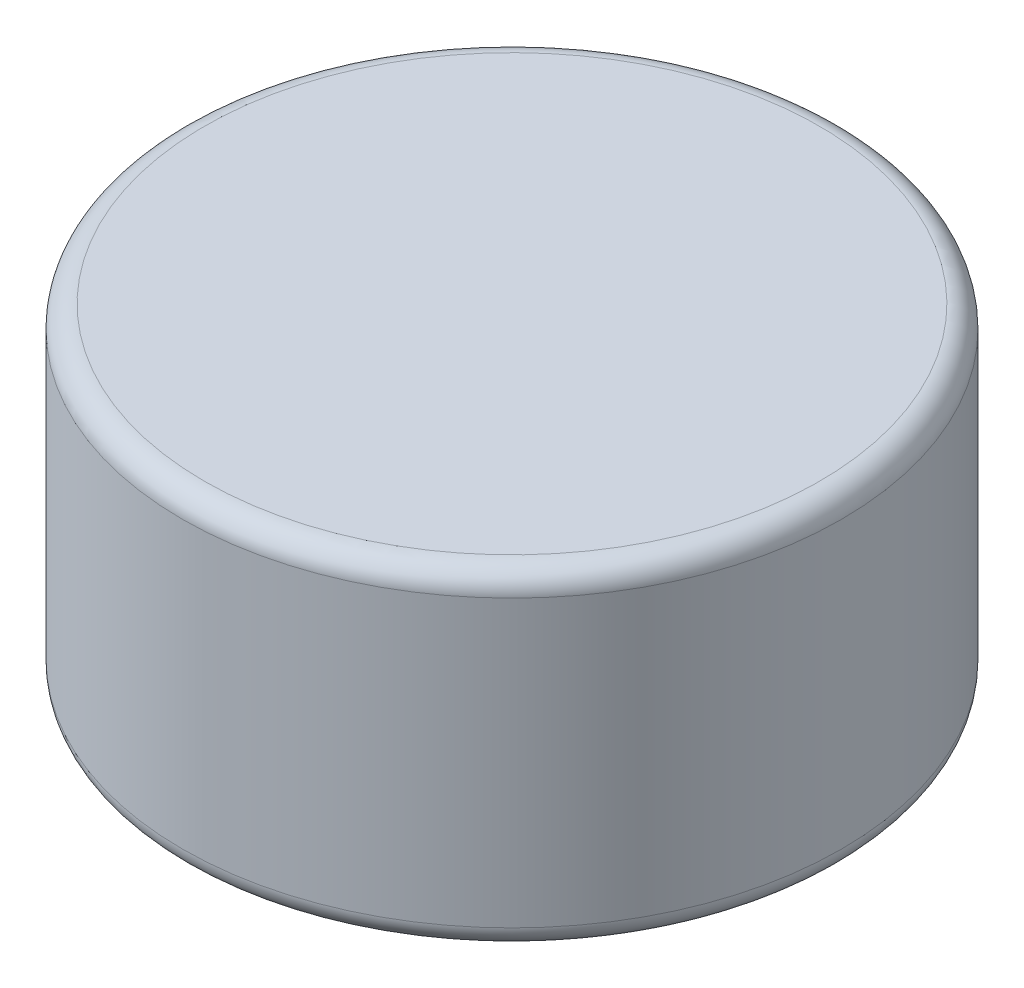
ISO-10303-21;
HEADER;
FILE_DESCRIPTION(('STEP AP214'),'2;1');
FILE_NAME('part.step','',(''),(''),'','','');
FILE_SCHEMA(('AUTOMOTIVE_DESIGN { 1 0 10303 214 1 1 1 1 }'));
ENDSEC;
DATA;
#1=APPLICATION_CONTEXT('core data for automotive mechanical design processes');
#2=APPLICATION_PROTOCOL_DEFINITION('international standard','automotive_design',2000,#1);
#3=PRODUCT_CONTEXT('',#1,'mechanical');
#4=PRODUCT('Part','Part','',(#3));
#5=PRODUCT_RELATED_PRODUCT_CATEGORY('part','',(#4));
#6=PRODUCT_DEFINITION_FORMATION('','',#4);
#7=PRODUCT_DEFINITION_CONTEXT('part definition',#1,'design');
#8=PRODUCT_DEFINITION('design','',#6,#7);
#9=PRODUCT_DEFINITION_SHAPE('','',#8);
#10=(LENGTH_UNIT() NAMED_UNIT(*) SI_UNIT(.MILLI.,.METRE.));
#11=(NAMED_UNIT(*) PLANE_ANGLE_UNIT() SI_UNIT($,.RADIAN.));
#12=(NAMED_UNIT(*) SI_UNIT($,.STERADIAN.) SOLID_ANGLE_UNIT());
#13=UNCERTAINTY_MEASURE_WITH_UNIT(LENGTH_MEASURE(1.E-05),#10,'distance_accuracy_value','');
#14=(GEOMETRIC_REPRESENTATION_CONTEXT(3) GLOBAL_UNCERTAINTY_ASSIGNED_CONTEXT((#13)) GLOBAL_UNIT_ASSIGNED_CONTEXT((#10,
#11,#12)) REPRESENTATION_CONTEXT('',''));
#15=CARTESIAN_POINT('',(0.,0.,0.));
#16=DIRECTION('',(0.,0.,1.));
#17=DIRECTION('',(1.,0.,0.));
#18=AXIS2_PLACEMENT_3D('',#15,#16,#17);
#19=CARTESIAN_POINT('',(0.,3.,0.));
#20=DIRECTION('',(0.,-1.,0.));
#21=DIRECTION('',(0.,0.,-1.));
#22=AXIS2_PLACEMENT_3D('',#19,#20,#21);
#23=CYLINDRICAL_SURFACE('',#22,3.);
#24=CARTESIAN_POINT('',(0.,0.2,0.));
#25=DIRECTION('',(0.,1.,0.));
#26=DIRECTION('',(0.,0.,1.));
#27=AXIS2_PLACEMENT_3D('',#24,#25,#26);
#28=CIRCLE('',#27,3.);
#29=CARTESIAN_POINT('',(0.,0.2,3.));
#30=VERTEX_POINT('',#29);
#31=EDGE_CURVE('E53',#30,#30,#28,.T.);
#32=ORIENTED_EDGE('',*,*,#31,.T.);
#33=EDGE_LOOP('',(#32));
#34=FACE_BOUND('',#33,.T.);
#35=CARTESIAN_POINT('',(0.,2.8,0.));
#36=DIRECTION('',(0.,1.,0.));
#37=DIRECTION('',(0.,0.,1.));
#38=AXIS2_PLACEMENT_3D('',#35,#36,#37);
#39=CIRCLE('',#38,3.);
#40=CARTESIAN_POINT('',(0.,2.8,3.));
#41=VERTEX_POINT('',#40);
#42=EDGE_CURVE('E58',#41,#41,#39,.F.);
#43=ORIENTED_EDGE('',*,*,#42,.T.);
#44=EDGE_LOOP('',(#43));
#45=FACE_BOUND('',#44,.T.);
#46=ADVANCED_FACE('F40',(#34,#45),#23,.T.);
#47=CARTESIAN_POINT('',(0.,3.,0.));
#48=DIRECTION('',(0.,1.,0.));
#49=DIRECTION('',(0.,0.,1.));
#50=AXIS2_PLACEMENT_3D('',#47,#48,#49);
#51=PLANE('',#50);
#52=CARTESIAN_POINT('',(0.,3.,0.));
#53=DIRECTION('',(0.,1.,0.));
#54=DIRECTION('',(0.,0.,1.));
#55=AXIS2_PLACEMENT_3D('',#52,#53,#54);
#56=CIRCLE('',#55,2.8);
#57=CARTESIAN_POINT('',(0.,3.,2.8));
#58=VERTEX_POINT('',#57);
#59=EDGE_CURVE('E10',#58,#58,#56,.T.);
#60=ORIENTED_EDGE('',*,*,#59,.T.);
#61=EDGE_LOOP('',(#60));
#62=FACE_BOUND('',#61,.T.);
#63=ADVANCED_FACE('F75',(#62),#51,.T.);
#64=CARTESIAN_POINT('',(0.,0.,0.));
#65=DIRECTION('',(0.,1.,0.));
#66=DIRECTION('',(0.,0.,1.));
#67=AXIS2_PLACEMENT_3D('',#64,#65,#66);
#68=PLANE('',#67);
#69=CARTESIAN_POINT('',(0.,0.,0.));
#70=DIRECTION('',(0.,1.,0.));
#71=DIRECTION('',(0.,0.,1.));
#72=AXIS2_PLACEMENT_3D('',#69,#70,#71);
#73=CIRCLE('',#72,2.8);
#74=CARTESIAN_POINT('',(0.,0.,2.8));
#75=VERTEX_POINT('',#74);
#76=EDGE_CURVE('E48',#75,#75,#73,.F.);
#77=ORIENTED_EDGE('',*,*,#76,.T.);
#78=EDGE_LOOP('',(#77));
#79=FACE_BOUND('',#78,.T.);
#80=ADVANCED_FACE('F72',(#79),#68,.F.);
#81=CARTESIAN_POINT('',(0.,0.2,0.));
#82=DIRECTION('',(0.,1.,0.));
#83=DIRECTION('',(0.,0.,1.));
#84=AXIS2_PLACEMENT_3D('',#81,#82,#83);
#85=TOROIDAL_SURFACE('',#84,2.8,0.2);
#86=ORIENTED_EDGE('',*,*,#76,.F.);
#87=EDGE_LOOP('',(#86));
#88=FACE_BOUND('',#87,.T.);
#89=ORIENTED_EDGE('',*,*,#31,.F.);
#90=EDGE_LOOP('',(#89));
#91=FACE_BOUND('',#90,.T.);
#92=ADVANCED_FACE('F68',(#88,#91),#85,.T.);
#93=CARTESIAN_POINT('',(0.,2.8,0.));
#94=DIRECTION('',(0.,1.,0.));
#95=DIRECTION('',(0.,0.,1.));
#96=AXIS2_PLACEMENT_3D('',#93,#94,#95);
#97=TOROIDAL_SURFACE('',#96,2.8,0.2);
#98=ORIENTED_EDGE('',*,*,#42,.F.);
#99=EDGE_LOOP('',(#98));
#100=FACE_BOUND('',#99,.T.);
#101=ORIENTED_EDGE('',*,*,#59,.F.);
#102=EDGE_LOOP('',(#101));
#103=FACE_BOUND('',#102,.T.);
#104=ADVANCED_FACE('F42',(#100,#103),#97,.T.);
#105=CLOSED_SHELL('',(#46,#63,#80,#92,#104));
#106=MANIFOLD_SOLID_BREP('B2',#105);
#107=ADVANCED_BREP_SHAPE_REPRESENTATION('',(#18,#106),#14);
#108=SHAPE_DEFINITION_REPRESENTATION(#9,#107);
ENDSEC;
END-ISO-10303-21;
